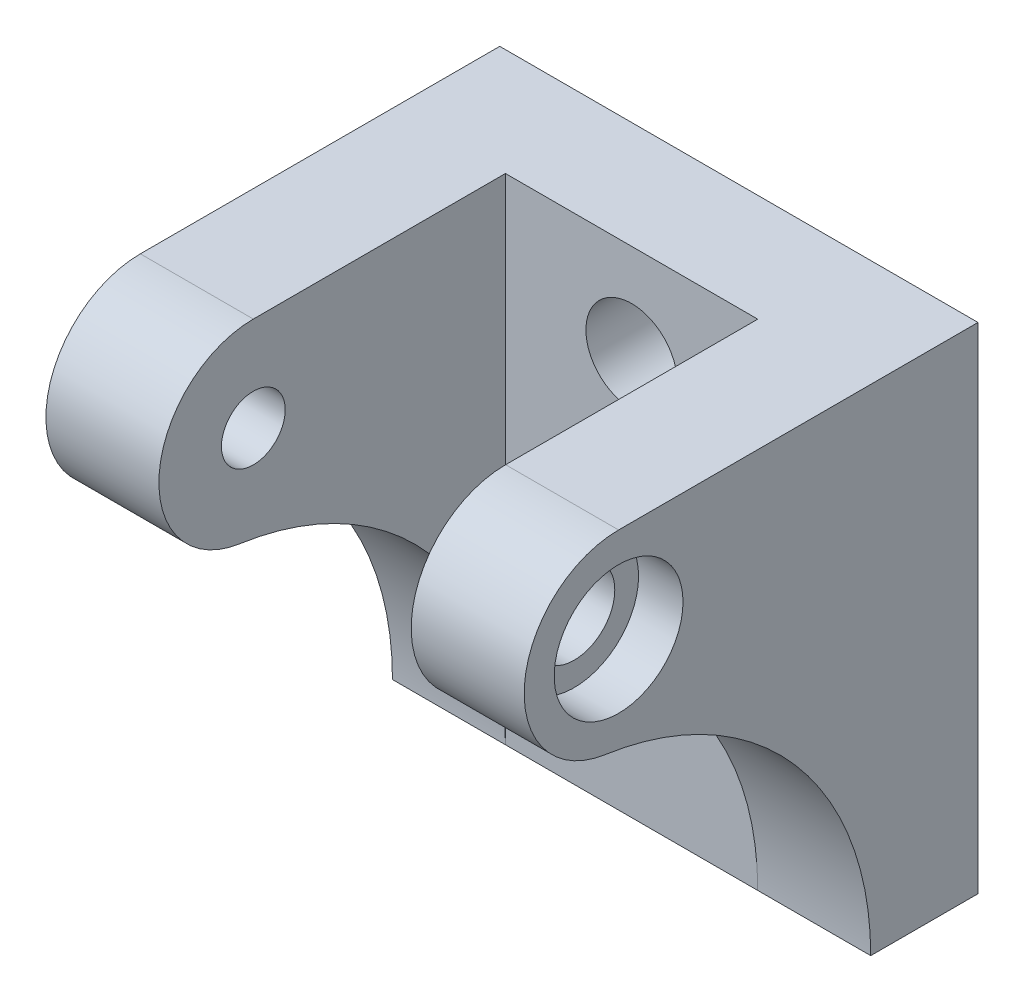
ISO-10303-21;
HEADER;
FILE_DESCRIPTION(('STEP AP214'),'2;1');
FILE_NAME('part.step','',(''),(''),'','','');
FILE_SCHEMA(('AUTOMOTIVE_DESIGN { 1 0 10303 214 1 1 1 1 }'));
ENDSEC;
DATA;
#1=APPLICATION_CONTEXT('core data for automotive mechanical design processes');
#2=APPLICATION_PROTOCOL_DEFINITION('international standard','automotive_design',2000,#1);
#3=PRODUCT_CONTEXT('',#1,'mechanical');
#4=PRODUCT('Part','Part','',(#3));
#5=PRODUCT_RELATED_PRODUCT_CATEGORY('part','',(#4));
#6=PRODUCT_DEFINITION_FORMATION('','',#4);
#7=PRODUCT_DEFINITION_CONTEXT('part definition',#1,'design');
#8=PRODUCT_DEFINITION('design','',#6,#7);
#9=PRODUCT_DEFINITION_SHAPE('','',#8);
#10=(LENGTH_UNIT() NAMED_UNIT(*) SI_UNIT(.MILLI.,.METRE.));
#11=(NAMED_UNIT(*) PLANE_ANGLE_UNIT() SI_UNIT($,.RADIAN.));
#12=(NAMED_UNIT(*) SI_UNIT($,.STERADIAN.) SOLID_ANGLE_UNIT());
#13=UNCERTAINTY_MEASURE_WITH_UNIT(LENGTH_MEASURE(1.E-05),#10,'distance_accuracy_value','');
#14=(GEOMETRIC_REPRESENTATION_CONTEXT(3) GLOBAL_UNCERTAINTY_ASSIGNED_CONTEXT((#13)) GLOBAL_UNIT_ASSIGNED_CONTEXT((#10,
#11,#12)) REPRESENTATION_CONTEXT('',''));
#15=CARTESIAN_POINT('',(0.,0.,0.));
#16=DIRECTION('',(0.,0.,1.));
#17=DIRECTION('',(1.,0.,0.));
#18=AXIS2_PLACEMENT_3D('',#15,#16,#17);
#19=CARTESIAN_POINT('',(84.3602391833658,63.8233482174211,-16.7807667272286));
#20=DIRECTION('',(1.,0.,0.));
#21=DIRECTION('',(0.,0.,-1.));
#22=AXIS2_PLACEMENT_3D('',#19,#20,#21);
#23=PLANE('',#22);
#24=CARTESIAN_POINT('',(84.3602391833658,63.8233482174211,-16.7807667272286));
#25=DIRECTION('',(1.,0.,0.));
#26=DIRECTION('',(0.,0.,-1.));
#27=AXIS2_PLACEMENT_3D('',#24,#25,#26);
#28=CIRCLE('',#27,3.2512);
#29=CARTESIAN_POINT('',(84.3602391833658,63.8233482174211,-20.0319667272286));
#30=VERTEX_POINT('',#29);
#31=EDGE_CURVE('E20',#30,#30,#28,.F.);
#32=ORIENTED_EDGE('',*,*,#31,.T.);
#33=EDGE_LOOP('',(#32));
#34=FACE_BOUND('',#33,.T.);
#35=CARTESIAN_POINT('',(84.3602391833658,63.8233482174211,-16.7807667272286));
#36=DIRECTION('',(1.,0.,0.));
#37=DIRECTION('',(0.,0.,-1.));
#38=AXIS2_PLACEMENT_3D('',#35,#36,#37);
#39=CIRCLE('',#38,5.1562);
#40=CARTESIAN_POINT('',(84.3602391833658,63.8233482174211,-21.9369667272286));
#41=VERTEX_POINT('',#40);
#42=EDGE_CURVE('E158',#41,#41,#39,.T.);
#43=ORIENTED_EDGE('',*,*,#42,.T.);
#44=EDGE_LOOP('',(#43));
#45=FACE_BOUND('',#44,.T.);
#46=ADVANCED_FACE('F17',(#34,#45),#23,.T.);
#47=CARTESIAN_POINT('',(49.6374141833658,63.8233482174211,-16.7807667272286));
#48=DIRECTION('',(1.,0.,0.));
#49=DIRECTION('',(0.,0.,-1.));
#50=AXIS2_PLACEMENT_3D('',#47,#48,#49);
#51=CYLINDRICAL_SURFACE('',#50,3.2512);
#52=ORIENTED_EDGE('',*,*,#31,.F.);
#53=EDGE_LOOP('',(#52));
#54=FACE_BOUND('',#53,.T.);
#55=CARTESIAN_POINT('',(78.8738391833658,63.8233482174211,-16.7807667272286));
#56=DIRECTION('',(1.,0.,0.));
#57=DIRECTION('',(0.,0.,-1.));
#58=AXIS2_PLACEMENT_3D('',#55,#56,#57);
#59=CIRCLE('',#58,3.2512);
#60=CARTESIAN_POINT('',(78.8738391833658,63.8233482174211,-20.0319667272286));
#61=VERTEX_POINT('',#60);
#62=EDGE_CURVE('E189',#61,#61,#59,.F.);
#63=ORIENTED_EDGE('',*,*,#62,.T.);
#64=EDGE_LOOP('',(#63));
#65=FACE_BOUND('',#64,.T.);
#66=ADVANCED_FACE('F199',(#54,#65),#51,.F.);
#67=CARTESIAN_POINT('',(84.3602391833658,63.8233482174211,-16.7807667272286));
#68=DIRECTION('',(1.,0.,0.));
#69=DIRECTION('',(0.,0.,-1.));
#70=AXIS2_PLACEMENT_3D('',#67,#68,#69);
#71=CYLINDRICAL_SURFACE('',#70,5.1562);
#72=CARTESIAN_POINT('',(87.9162391833658,63.8233482174211,-16.7807667272286));
#73=DIRECTION('',(1.,0.,0.));
#74=DIRECTION('',(0.,0.,-1.));
#75=AXIS2_PLACEMENT_3D('',#72,#73,#74);
#76=CIRCLE('',#75,5.1562);
#77=CARTESIAN_POINT('',(87.9162391833658,63.8233482174211,-21.9369667272286));
#78=VERTEX_POINT('',#77);
#79=EDGE_CURVE('E143',#78,#78,#76,.T.);
#80=ORIENTED_EDGE('',*,*,#79,.T.);
#81=EDGE_LOOP('',(#80));
#82=FACE_BOUND('',#81,.T.);
#83=ORIENTED_EDGE('',*,*,#42,.F.);
#84=EDGE_LOOP('',(#83));
#85=FACE_BOUND('',#84,.T.);
#86=ADVANCED_FACE('F202',(#82,#85),#71,.F.);
#87=CARTESIAN_POINT('',(87.9162391833658,31.7812482174211,-12.1413328673385));
#88=DIRECTION('',(-1.,0.,0.));
#89=DIRECTION('',(0.,0.,1.));
#90=AXIS2_PLACEMENT_3D('',#87,#88,#89);
#91=CYLINDRICAL_SURFACE('',#90,24.8197338598901);
#92=CARTESIAN_POINT('',(87.9162391833658,31.7812482174211,-12.1413328673385));
#93=DIRECTION('',(-1.,0.,0.));
#94=DIRECTION('',(0.,0.,1.));
#95=AXIS2_PLACEMENT_3D('',#92,#93,#94);
#96=CIRCLE('',#95,24.8197338598901);
#97=CARTESIAN_POINT('',(87.9162391833658,31.7812482174211,-36.9610667272287));
#98=VERTEX_POINT('',#97);
#99=CARTESIAN_POINT('',(87.9162391833658,56.3448338942971,-15.6979390544988));
#100=VERTEX_POINT('',#99);
#101=EDGE_CURVE('E179',#98,#100,#96,.F.);
#102=ORIENTED_EDGE('',*,*,#101,.T.);
#103=DIRECTION('',(-1.,0.,0.));
#104=VECTOR('',#103,1.);
#105=CARTESIAN_POINT('',(87.9162391833658,56.3448338942972,-15.6979390544988));
#106=LINE('',#105,#104);
#107=CARTESIAN_POINT('',(78.8738391833658,56.3448338942972,-15.6979390544988));
#108=VERTEX_POINT('',#107);
#109=EDGE_CURVE('E106',#108,#100,#106,.F.);
#110=ORIENTED_EDGE('',*,*,#109,.F.);
#111=CARTESIAN_POINT('',(78.8738391833658,31.7812482174211,-12.1413328673385));
#112=DIRECTION('',(-1.,0.,0.));
#113=DIRECTION('',(0.,0.,1.));
#114=AXIS2_PLACEMENT_3D('',#111,#112,#113);
#115=CIRCLE('',#114,24.8197338598901);
#116=CARTESIAN_POINT('',(78.8738391833658,31.7812482174211,-36.9610667272287));
#117=VERTEX_POINT('',#116);
#118=EDGE_CURVE('E105',#108,#117,#115,.T.);
#119=ORIENTED_EDGE('',*,*,#118,.T.);
#120=DIRECTION('',(1.,0.,0.));
#121=VECTOR('',#120,1.);
#122=CARTESIAN_POINT('',(49.6384391833658,31.7812482174211,-36.9610667272287));
#123=LINE('',#122,#121);
#124=EDGE_CURVE('E149',#117,#98,#123,.T.);
#125=ORIENTED_EDGE('',*,*,#124,.T.);
#126=EDGE_LOOP('',(#102,#110,#119,#125));
#127=FACE_BOUND('',#126,.T.);
#128=ADVANCED_FACE('F283',(#127),#91,.F.);
#129=CARTESIAN_POINT('',(87.9162391833658,31.7812482174211,-12.1413328673385));
#130=DIRECTION('',(-1.,0.,0.));
#131=DIRECTION('',(0.,0.,1.));
#132=AXIS2_PLACEMENT_3D('',#129,#130,#131);
#133=CYLINDRICAL_SURFACE('',#132,24.8197338598901);
#134=CARTESIAN_POINT('',(49.6384391833658,31.7812482174211,-12.1413328673385));
#135=DIRECTION('',(-1.,0.,0.));
#136=DIRECTION('',(0.,0.,1.));
#137=AXIS2_PLACEMENT_3D('',#134,#135,#136);
#138=CIRCLE('',#137,24.8197338598901);
#139=CARTESIAN_POINT('',(49.6384391833658,56.3448338942972,-15.6979390544988));
#140=VERTEX_POINT('',#139);
#141=CARTESIAN_POINT('',(49.6384391833658,31.7812482174211,-36.9610667272287));
#142=VERTEX_POINT('',#141);
#143=EDGE_CURVE('E170',#140,#142,#138,.T.);
#144=ORIENTED_EDGE('',*,*,#143,.T.);
#145=DIRECTION('',(1.,0.,0.));
#146=VECTOR('',#145,1.);
#147=CARTESIAN_POINT('',(49.6384391833658,31.7812482174211,-36.9610667272287));
#148=LINE('',#147,#146);
#149=CARTESIAN_POINT('',(58.6808391833658,31.7812482174211,-36.9610667272287));
#150=VERTEX_POINT('',#149);
#151=EDGE_CURVE('E139',#142,#150,#148,.T.);
#152=ORIENTED_EDGE('',*,*,#151,.T.);
#153=CARTESIAN_POINT('',(58.6808391833658,31.7812482174211,-12.1413328673385));
#154=DIRECTION('',(-1.,0.,0.));
#155=DIRECTION('',(0.,0.,1.));
#156=AXIS2_PLACEMENT_3D('',#153,#154,#155);
#157=CIRCLE('',#156,24.8197338598901);
#158=CARTESIAN_POINT('',(58.6808391833658,56.3448338942971,-15.6979390544988));
#159=VERTEX_POINT('',#158);
#160=EDGE_CURVE('E187',#150,#159,#157,.F.);
#161=ORIENTED_EDGE('',*,*,#160,.T.);
#162=DIRECTION('',(-1.,0.,0.));
#163=VECTOR('',#162,1.);
#164=CARTESIAN_POINT('',(87.9162391833658,56.3448338942972,-15.6979390544988));
#165=LINE('',#164,#163);
#166=EDGE_CURVE('E134',#140,#159,#165,.F.);
#167=ORIENTED_EDGE('',*,*,#166,.F.);
#168=EDGE_LOOP('',(#144,#152,#161,#167));
#169=FACE_BOUND('',#168,.T.);
#170=ADVANCED_FACE('F259',(#169),#133,.F.);
#171=CARTESIAN_POINT('',(49.6384391833658,63.8233482174211,-16.7807667272286));
#172=DIRECTION('',(-1.,0.,0.));
#173=DIRECTION('',(0.,0.,1.));
#174=AXIS2_PLACEMENT_3D('',#171,#172,#173);
#175=CYLINDRICAL_SURFACE('',#174,2.5527);
#176=CARTESIAN_POINT('',(49.6384391833658,63.8233482174211,-16.7807667272286));
#177=DIRECTION('',(-1.,0.,0.));
#178=DIRECTION('',(0.,0.,1.));
#179=AXIS2_PLACEMENT_3D('',#176,#177,#178);
#180=CIRCLE('',#179,2.5527);
#181=CARTESIAN_POINT('',(49.6384391833658,63.8233482174211,-14.2280667272286));
#182=VERTEX_POINT('',#181);
#183=EDGE_CURVE('E124',#182,#182,#180,.T.);
#184=ORIENTED_EDGE('',*,*,#183,.T.);
#185=EDGE_LOOP('',(#184));
#186=FACE_BOUND('',#185,.T.);
#187=CARTESIAN_POINT('',(58.6808391833658,63.8233482174211,-16.7807667272286));
#188=DIRECTION('',(-1.,0.,0.));
#189=DIRECTION('',(0.,0.,1.));
#190=AXIS2_PLACEMENT_3D('',#187,#188,#189);
#191=CIRCLE('',#190,2.5527);
#192=CARTESIAN_POINT('',(58.6808391833658,63.8233482174211,-14.2280667272286));
#193=VERTEX_POINT('',#192);
#194=EDGE_CURVE('E138',#193,#193,#191,.F.);
#195=ORIENTED_EDGE('',*,*,#194,.T.);
#196=EDGE_LOOP('',(#195));
#197=FACE_BOUND('',#196,.T.);
#198=ADVANCED_FACE('F216',(#186,#197),#175,.F.);
#199=CARTESIAN_POINT('',(87.9162391833658,63.8233482174211,-16.7807667272286));
#200=DIRECTION('',(-1.,0.,0.));
#201=DIRECTION('',(0.,0.,1.));
#202=AXIS2_PLACEMENT_3D('',#199,#200,#201);
#203=CYLINDRICAL_SURFACE('',#202,7.5565);
#204=CARTESIAN_POINT('',(87.9162391833658,63.8233482174211,-16.7807667272286));
#205=DIRECTION('',(-1.,0.,0.));
#206=DIRECTION('',(0.,0.,1.));
#207=AXIS2_PLACEMENT_3D('',#204,#205,#206);
#208=CIRCLE('',#207,7.5565);
#209=CARTESIAN_POINT('',(87.9162391833658,71.3798482174211,-16.7807667272286));
#210=VERTEX_POINT('',#209);
#211=EDGE_CURVE('E93',#100,#210,#208,.T.);
#212=ORIENTED_EDGE('',*,*,#211,.T.);
#213=DIRECTION('',(1.,0.,0.));
#214=VECTOR('',#213,1.);
#215=CARTESIAN_POINT('',(49.6384391833658,71.3798482174211,-16.7807667272286));
#216=LINE('',#215,#214);
#217=CARTESIAN_POINT('',(78.8738391833658,71.3798482174211,-16.7807667272286));
#218=VERTEX_POINT('',#217);
#219=EDGE_CURVE('E86',#210,#218,#216,.F.);
#220=ORIENTED_EDGE('',*,*,#219,.T.);
#221=CARTESIAN_POINT('',(78.8738391833658,63.8233482174211,-16.7807667272286));
#222=DIRECTION('',(-1.,0.,0.));
#223=DIRECTION('',(0.,0.,1.));
#224=AXIS2_PLACEMENT_3D('',#221,#222,#223);
#225=CIRCLE('',#224,7.5565);
#226=EDGE_CURVE('E90',#218,#108,#225,.F.);
#227=ORIENTED_EDGE('',*,*,#226,.T.);
#228=ORIENTED_EDGE('',*,*,#109,.T.);
#229=EDGE_LOOP('',(#212,#220,#227,#228));
#230=FACE_BOUND('',#229,.T.);
#231=ADVANCED_FACE('F88',(#230),#203,.T.);
#232=CARTESIAN_POINT('',(78.8738391833658,71.3798482174211,-9.22426672722861));
#233=DIRECTION('',(1.,0.,0.));
#234=DIRECTION('',(0.,1.,0.));
#235=AXIS2_PLACEMENT_3D('',#232,#233,#234);
#236=PLANE('',#235);
#237=ORIENTED_EDGE('',*,*,#62,.F.);
#238=EDGE_LOOP('',(#237));
#239=FACE_BOUND('',#238,.T.);
#240=ORIENTED_EDGE('',*,*,#226,.F.);
#241=DIRECTION('',(0.,0.,-1.));
#242=VECTOR('',#241,1.);
#243=CARTESIAN_POINT('',(78.8738391833658,71.3798482174211,-36.9610667272287));
#244=LINE('',#243,#242);
#245=CARTESIAN_POINT('',(78.8738391833658,71.3798482174211,-36.9610667272287));
#246=VERTEX_POINT('',#245);
#247=EDGE_CURVE('E98',#218,#246,#244,.T.);
#248=ORIENTED_EDGE('',*,*,#247,.T.);
#249=DIRECTION('',(0.,1.,0.));
#250=VECTOR('',#249,1.);
#251=CARTESIAN_POINT('',(78.8738391833658,51.5805482174211,-36.9610667272287));
#252=LINE('',#251,#250);
#253=EDGE_CURVE('E181',#246,#117,#252,.F.);
#254=ORIENTED_EDGE('',*,*,#253,.T.);
#255=ORIENTED_EDGE('',*,*,#118,.F.);
#256=EDGE_LOOP('',(#240,#248,#254,#255));
#257=FACE_BOUND('',#256,.T.);
#258=ADVANCED_FACE('F102',(#239,#257),#236,.F.);
#259=CARTESIAN_POINT('',(58.6808391833658,71.3798482174211,-9.22426672722861));
#260=DIRECTION('',(-1.,0.,0.));
#261=DIRECTION('',(0.,-1.,0.));
#262=AXIS2_PLACEMENT_3D('',#259,#260,#261);
#263=PLANE('',#262);
#264=ORIENTED_EDGE('',*,*,#194,.F.);
#265=EDGE_LOOP('',(#264));
#266=FACE_BOUND('',#265,.T.);
#267=ORIENTED_EDGE('',*,*,#160,.F.);
#268=DIRECTION('',(0.,1.,0.));
#269=VECTOR('',#268,1.);
#270=CARTESIAN_POINT('',(58.6808391833658,51.5805482174211,-36.9610667272287));
#271=LINE('',#270,#269);
#272=CARTESIAN_POINT('',(58.6808391833658,71.3798482174211,-36.9610667272287));
#273=VERTEX_POINT('',#272);
#274=EDGE_CURVE('E184',#150,#273,#271,.T.);
#275=ORIENTED_EDGE('',*,*,#274,.T.);
#276=DIRECTION('',(0.,0.,-1.));
#277=VECTOR('',#276,1.);
#278=CARTESIAN_POINT('',(58.6808391833658,71.3798482174211,-36.9610667272287));
#279=LINE('',#278,#277);
#280=CARTESIAN_POINT('',(58.6808391833658,71.3798482174211,-16.7807667272286));
#281=VERTEX_POINT('',#280);
#282=EDGE_CURVE('E115',#273,#281,#279,.F.);
#283=ORIENTED_EDGE('',*,*,#282,.T.);
#284=CARTESIAN_POINT('',(58.6808391833658,63.8233482174211,-16.7807667272286));
#285=DIRECTION('',(-1.,0.,0.));
#286=DIRECTION('',(0.,0.,1.));
#287=AXIS2_PLACEMENT_3D('',#284,#285,#286);
#288=CIRCLE('',#287,7.5565);
#289=EDGE_CURVE('E137',#159,#281,#288,.T.);
#290=ORIENTED_EDGE('',*,*,#289,.F.);
#291=EDGE_LOOP('',(#267,#275,#283,#290));
#292=FACE_BOUND('',#291,.T.);
#293=ADVANCED_FACE('F206',(#266,#292),#263,.F.);
#294=CARTESIAN_POINT('',(87.9162391833658,63.8233482174211,-16.7807667272286));
#295=DIRECTION('',(-1.,0.,0.));
#296=DIRECTION('',(0.,0.,1.));
#297=AXIS2_PLACEMENT_3D('',#294,#295,#296);
#298=CYLINDRICAL_SURFACE('',#297,7.5565);
#299=ORIENTED_EDGE('',*,*,#166,.T.);
#300=ORIENTED_EDGE('',*,*,#289,.T.);
#301=DIRECTION('',(1.,0.,0.));
#302=VECTOR('',#301,1.);
#303=CARTESIAN_POINT('',(49.6384391833658,71.3798482174211,-16.7807667272286));
#304=LINE('',#303,#302);
#305=CARTESIAN_POINT('',(49.6384391833658,71.3798482174211,-16.7807667272286));
#306=VERTEX_POINT('',#305);
#307=EDGE_CURVE('E263',#281,#306,#304,.F.);
#308=ORIENTED_EDGE('',*,*,#307,.T.);
#309=CARTESIAN_POINT('',(49.6384391833658,63.8233482174211,-16.7807667272286));
#310=DIRECTION('',(-1.,0.,0.));
#311=DIRECTION('',(0.,0.,1.));
#312=AXIS2_PLACEMENT_3D('',#309,#310,#311);
#313=CIRCLE('',#312,7.5565);
#314=EDGE_CURVE('E173',#306,#140,#313,.F.);
#315=ORIENTED_EDGE('',*,*,#314,.T.);
#316=EDGE_LOOP('',(#299,#300,#308,#315));
#317=FACE_BOUND('',#316,.T.);
#318=ADVANCED_FACE('F213',(#317),#298,.T.);
#319=CARTESIAN_POINT('',(68.7773391833658,51.5805482174211,-36.9610667272287));
#320=DIRECTION('',(0.,0.,-1.));
#321=DIRECTION('',(0.,1.,0.));
#322=AXIS2_PLACEMENT_3D('',#319,#320,#321);
#323=PLANE('',#322);
#324=CARTESIAN_POINT('',(68.7773391833658,63.7598482174211,-36.9610667272287));
#325=DIRECTION('',(0.,0.,1.));
#326=DIRECTION('',(0.,-1.,0.));
#327=AXIS2_PLACEMENT_3D('',#324,#325,#326);
#328=CIRCLE('',#327,3.6576);
#329=CARTESIAN_POINT('',(68.7773391833658,60.1022482174211,-36.9610667272287));
#330=VERTEX_POINT('',#329);
#331=EDGE_CURVE('E131',#330,#330,#328,.F.);
#332=ORIENTED_EDGE('',*,*,#331,.T.);
#333=EDGE_LOOP('',(#332));
#334=FACE_BOUND('',#333,.T.);
#335=CARTESIAN_POINT('',(68.7773391833658,41.7253482174211,-36.9610667272287));
#336=DIRECTION('',(0.,0.,1.));
#337=DIRECTION('',(0.,-1.,0.));
#338=AXIS2_PLACEMENT_3D('',#335,#336,#337);
#339=CIRCLE('',#338,3.6576);
#340=CARTESIAN_POINT('',(68.7773391833658,38.0677482174211,-36.9610667272287));
#341=VERTEX_POINT('',#340);
#342=EDGE_CURVE('E165',#341,#341,#339,.F.);
#343=ORIENTED_EDGE('',*,*,#342,.T.);
#344=EDGE_LOOP('',(#343));
#345=FACE_BOUND('',#344,.T.);
#346=DIRECTION('',(1.,0.,0.));
#347=VECTOR('',#346,1.);
#348=CARTESIAN_POINT('',(49.6384391833658,71.3798482174211,-36.9610667272287));
#349=LINE('',#348,#347);
#350=EDGE_CURVE('E113',#246,#273,#349,.F.);
#351=ORIENTED_EDGE('',*,*,#350,.T.);
#352=ORIENTED_EDGE('',*,*,#274,.F.);
#353=DIRECTION('',(1.,0.,0.));
#354=VECTOR('',#353,1.);
#355=CARTESIAN_POINT('',(49.6384391833658,31.7812482174211,-36.9610667272287));
#356=LINE('',#355,#354);
#357=EDGE_CURVE('E142',#150,#117,#356,.T.);
#358=ORIENTED_EDGE('',*,*,#357,.T.);
#359=ORIENTED_EDGE('',*,*,#253,.F.);
#360=EDGE_LOOP('',(#351,#352,#358,#359));
#361=FACE_BOUND('',#360,.T.);
#362=ADVANCED_FACE('F247',(#334,#345,#361),#323,.F.);
#363=CARTESIAN_POINT('',(87.9162391833658,31.7812482174211,-36.9610667272287));
#364=DIRECTION('',(-1.,0.,0.));
#365=DIRECTION('',(0.,0.,1.));
#366=AXIS2_PLACEMENT_3D('',#363,#364,#365);
#367=PLANE('',#366);
#368=ORIENTED_EDGE('',*,*,#79,.F.);
#369=EDGE_LOOP('',(#368));
#370=FACE_BOUND('',#369,.T.);
#371=ORIENTED_EDGE('',*,*,#101,.F.);
#372=DIRECTION('',(0.,0.,1.));
#373=VECTOR('',#372,1.);
#374=CARTESIAN_POINT('',(87.9162391833658,31.7812482174211,-36.9610667272287));
#375=LINE('',#374,#373);
#376=CARTESIAN_POINT('',(87.9162391833658,31.7812482174211,-45.5462667272287));
#377=VERTEX_POINT('',#376);
#378=EDGE_CURVE('E151',#98,#377,#375,.F.);
#379=ORIENTED_EDGE('',*,*,#378,.T.);
#380=DIRECTION('',(0.,1.,0.));
#381=VECTOR('',#380,1.);
#382=CARTESIAN_POINT('',(87.9162391833658,51.5805482174211,-45.5462667272287));
#383=LINE('',#382,#381);
#384=CARTESIAN_POINT('',(87.9162391833658,71.3798482174211,-45.5462667272287));
#385=VERTEX_POINT('',#384);
#386=EDGE_CURVE('E127',#385,#377,#383,.F.);
#387=ORIENTED_EDGE('',*,*,#386,.F.);
#388=DIRECTION('',(0.,0.,-1.));
#389=VECTOR('',#388,1.);
#390=CARTESIAN_POINT('',(87.9162391833658,71.3798482174211,-36.9610667272287));
#391=LINE('',#390,#389);
#392=EDGE_CURVE('E99',#385,#210,#391,.F.);
#393=ORIENTED_EDGE('',*,*,#392,.T.);
#394=ORIENTED_EDGE('',*,*,#211,.F.);
#395=EDGE_LOOP('',(#371,#379,#387,#393,#394));
#396=FACE_BOUND('',#395,.T.);
#397=ADVANCED_FACE('F243',(#370,#396),#367,.F.);
#398=CARTESIAN_POINT('',(49.6384391833658,31.7812482174211,-36.9610667272287));
#399=DIRECTION('',(0.,1.,0.));
#400=DIRECTION('',(0.,0.,1.));
#401=AXIS2_PLACEMENT_3D('',#398,#399,#400);
#402=PLANE('',#401);
#403=ORIENTED_EDGE('',*,*,#124,.F.);
#404=ORIENTED_EDGE('',*,*,#357,.F.);
#405=ORIENTED_EDGE('',*,*,#151,.F.);
#406=DIRECTION('',(0.,0.,-1.));
#407=VECTOR('',#406,1.);
#408=CARTESIAN_POINT('',(49.6384391833658,31.7812482174211,-36.9610667272287));
#409=LINE('',#408,#407);
#410=CARTESIAN_POINT('',(49.6384391833658,31.7812482174211,-45.5462667272287));
#411=VERTEX_POINT('',#410);
#412=EDGE_CURVE('E153',#142,#411,#409,.T.);
#413=ORIENTED_EDGE('',*,*,#412,.T.);
#414=DIRECTION('',(1.,0.,0.));
#415=VECTOR('',#414,1.);
#416=CARTESIAN_POINT('',(68.7773391833658,31.7812482174211,-45.5462667272287));
#417=LINE('',#416,#415);
#418=EDGE_CURVE('E130',#377,#411,#417,.F.);
#419=ORIENTED_EDGE('',*,*,#418,.F.);
#420=ORIENTED_EDGE('',*,*,#378,.F.);
#421=EDGE_LOOP('',(#403,#404,#405,#413,#419,#420));
#422=FACE_BOUND('',#421,.T.);
#423=ADVANCED_FACE('F239',(#422),#402,.F.);
#424=CARTESIAN_POINT('',(49.6384391833658,31.7812482174211,-36.9610667272287));
#425=DIRECTION('',(1.,0.,0.));
#426=DIRECTION('',(0.,0.,-1.));
#427=AXIS2_PLACEMENT_3D('',#424,#425,#426);
#428=PLANE('',#427);
#429=ORIENTED_EDGE('',*,*,#183,.F.);
#430=EDGE_LOOP('',(#429));
#431=FACE_BOUND('',#430,.T.);
#432=ORIENTED_EDGE('',*,*,#314,.F.);
#433=DIRECTION('',(0.,0.,-1.));
#434=VECTOR('',#433,1.);
#435=CARTESIAN_POINT('',(49.6384391833658,71.3798482174211,-36.9610667272287));
#436=LINE('',#435,#434);
#437=CARTESIAN_POINT('',(49.6384391833658,71.3798482174211,-45.5462667272287));
#438=VERTEX_POINT('',#437);
#439=EDGE_CURVE('E35',#306,#438,#436,.T.);
#440=ORIENTED_EDGE('',*,*,#439,.T.);
#441=DIRECTION('',(0.,1.,0.));
#442=VECTOR('',#441,1.);
#443=CARTESIAN_POINT('',(49.6384391833658,51.5805482174211,-45.5462667272287));
#444=LINE('',#443,#442);
#445=EDGE_CURVE('E146',#411,#438,#444,.T.);
#446=ORIENTED_EDGE('',*,*,#445,.F.);
#447=ORIENTED_EDGE('',*,*,#412,.F.);
#448=ORIENTED_EDGE('',*,*,#143,.F.);
#449=EDGE_LOOP('',(#432,#440,#446,#447,#448));
#450=FACE_BOUND('',#449,.T.);
#451=ADVANCED_FACE('F236',(#431,#450),#428,.F.);
#452=CARTESIAN_POINT('',(49.6384391833658,71.3798482174211,-36.9610667272287));
#453=DIRECTION('',(0.,-1.,0.));
#454=DIRECTION('',(0.,0.,-1.));
#455=AXIS2_PLACEMENT_3D('',#452,#453,#454);
#456=PLANE('',#455);
#457=ORIENTED_EDGE('',*,*,#307,.F.);
#458=ORIENTED_EDGE('',*,*,#282,.F.);
#459=ORIENTED_EDGE('',*,*,#350,.F.);
#460=ORIENTED_EDGE('',*,*,#247,.F.);
#461=ORIENTED_EDGE('',*,*,#219,.F.);
#462=ORIENTED_EDGE('',*,*,#392,.F.);
#463=DIRECTION('',(1.,0.,0.));
#464=VECTOR('',#463,1.);
#465=CARTESIAN_POINT('',(68.7773391833658,71.3798482174211,-45.5462667272287));
#466=LINE('',#465,#464);
#467=EDGE_CURVE('E162',#438,#385,#466,.T.);
#468=ORIENTED_EDGE('',*,*,#467,.F.);
#469=ORIENTED_EDGE('',*,*,#439,.F.);
#470=EDGE_LOOP('',(#457,#458,#459,#460,#461,#462,#468,#469));
#471=FACE_BOUND('',#470,.T.);
#472=ADVANCED_FACE('F110',(#471),#456,.F.);
#473=CARTESIAN_POINT('',(68.7773391833658,41.7253482174211,-45.5462667272287));
#474=DIRECTION('',(0.,0.,1.));
#475=DIRECTION('',(0.,-1.,0.));
#476=AXIS2_PLACEMENT_3D('',#473,#474,#475);
#477=CYLINDRICAL_SURFACE('',#476,3.6576);
#478=ORIENTED_EDGE('',*,*,#342,.F.);
#479=EDGE_LOOP('',(#478));
#480=FACE_BOUND('',#479,.T.);
#481=CARTESIAN_POINT('',(68.7773391833658,41.7253482174211,-45.5462667272287));
#482=DIRECTION('',(0.,0.,1.));
#483=DIRECTION('',(0.,-1.,0.));
#484=AXIS2_PLACEMENT_3D('',#481,#482,#483);
#485=CIRCLE('',#484,3.6576);
#486=CARTESIAN_POINT('',(68.7773391833658,38.0677482174211,-45.5462667272287));
#487=VERTEX_POINT('',#486);
#488=EDGE_CURVE('E26',#487,#487,#485,.T.);
#489=ORIENTED_EDGE('',*,*,#488,.F.);
#490=EDGE_LOOP('',(#489));
#491=FACE_BOUND('',#490,.T.);
#492=ADVANCED_FACE('F226',(#480,#491),#477,.F.);
#493=CARTESIAN_POINT('',(68.7773391833658,63.7598482174211,-45.5462667272287));
#494=DIRECTION('',(0.,0.,1.));
#495=DIRECTION('',(0.,-1.,0.));
#496=AXIS2_PLACEMENT_3D('',#493,#494,#495);
#497=CYLINDRICAL_SURFACE('',#496,3.6576);
#498=ORIENTED_EDGE('',*,*,#331,.F.);
#499=EDGE_LOOP('',(#498));
#500=FACE_BOUND('',#499,.T.);
#501=CARTESIAN_POINT('',(68.7773391833658,63.7598482174211,-45.5462667272287));
#502=DIRECTION('',(0.,0.,1.));
#503=DIRECTION('',(0.,-1.,0.));
#504=AXIS2_PLACEMENT_3D('',#501,#502,#503);
#505=CIRCLE('',#504,3.6576);
#506=CARTESIAN_POINT('',(68.7773391833658,60.1022482174211,-45.5462667272287));
#507=VERTEX_POINT('',#506);
#508=EDGE_CURVE('E11',#507,#507,#505,.T.);
#509=ORIENTED_EDGE('',*,*,#508,.F.);
#510=EDGE_LOOP('',(#509));
#511=FACE_BOUND('',#510,.T.);
#512=ADVANCED_FACE('F220',(#500,#511),#497,.F.);
#513=CARTESIAN_POINT('',(68.7773391833658,51.5805482174211,-45.5462667272287));
#514=DIRECTION('',(0.,0.,-1.));
#515=DIRECTION('',(0.,1.,0.));
#516=AXIS2_PLACEMENT_3D('',#513,#514,#515);
#517=PLANE('',#516);
#518=ORIENTED_EDGE('',*,*,#508,.T.);
#519=EDGE_LOOP('',(#518));
#520=FACE_BOUND('',#519,.T.);
#521=ORIENTED_EDGE('',*,*,#488,.T.);
#522=EDGE_LOOP('',(#521));
#523=FACE_BOUND('',#522,.T.);
#524=ORIENTED_EDGE('',*,*,#445,.T.);
#525=ORIENTED_EDGE('',*,*,#467,.T.);
#526=ORIENTED_EDGE('',*,*,#386,.T.);
#527=ORIENTED_EDGE('',*,*,#418,.T.);
#528=EDGE_LOOP('',(#524,#525,#526,#527));
#529=FACE_BOUND('',#528,.T.);
#530=ADVANCED_FACE('F218',(#520,#523,#529),#517,.T.);
#531=CLOSED_SHELL('',(#46,#66,#86,#128,#170,#198,#231,#258,#293,#318,#362,#397,#423,#451,#472,
#492,#512,#530));
#532=MANIFOLD_SOLID_BREP('B1',#531);
#533=ADVANCED_BREP_SHAPE_REPRESENTATION('',(#18,#532),#14);
#534=SHAPE_DEFINITION_REPRESENTATION(#9,#533);
ENDSEC;
END-ISO-10303-21;
